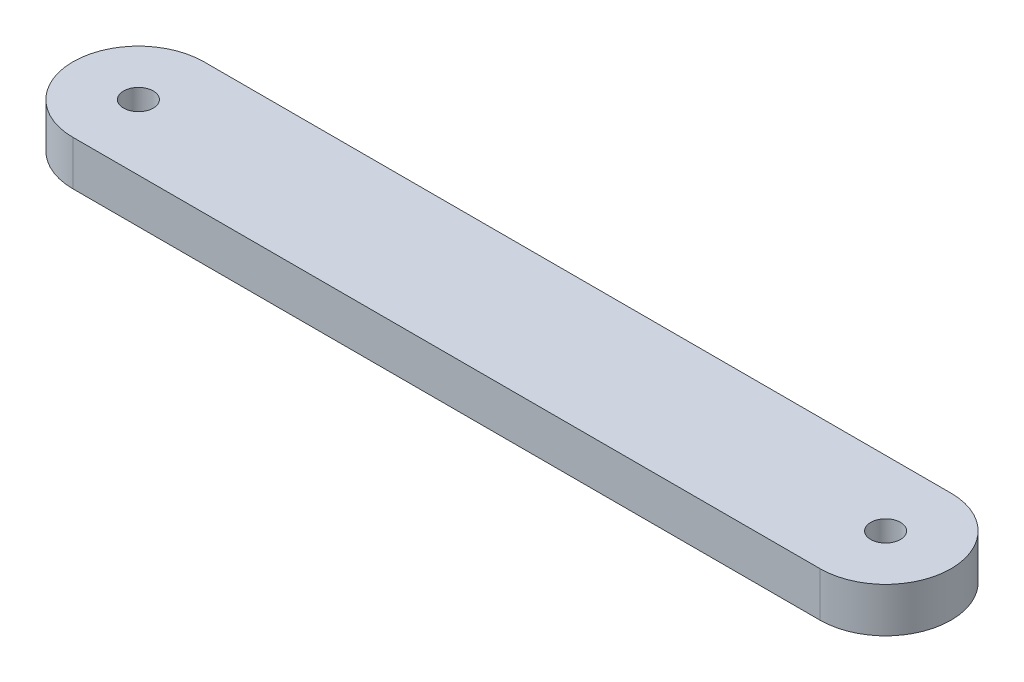
ISO-10303-21;
HEADER;
FILE_DESCRIPTION(('STEP AP214'),'2;1');
FILE_NAME('part.step','',(''),(''),'','','');
FILE_SCHEMA(('AUTOMOTIVE_DESIGN { 1 0 10303 214 1 1 1 1 }'));
ENDSEC;
DATA;
#1=APPLICATION_CONTEXT('core data for automotive mechanical design processes');
#2=APPLICATION_PROTOCOL_DEFINITION('international standard','automotive_design',2000,#1);
#3=PRODUCT_CONTEXT('',#1,'mechanical');
#4=PRODUCT('Part','Part','',(#3));
#5=PRODUCT_RELATED_PRODUCT_CATEGORY('part','',(#4));
#6=PRODUCT_DEFINITION_FORMATION('','',#4);
#7=PRODUCT_DEFINITION_CONTEXT('part definition',#1,'design');
#8=PRODUCT_DEFINITION('design','',#6,#7);
#9=PRODUCT_DEFINITION_SHAPE('','',#8);
#10=(LENGTH_UNIT() NAMED_UNIT(*) SI_UNIT(.MILLI.,.METRE.));
#11=(NAMED_UNIT(*) PLANE_ANGLE_UNIT() SI_UNIT($,.RADIAN.));
#12=(NAMED_UNIT(*) SI_UNIT($,.STERADIAN.) SOLID_ANGLE_UNIT());
#13=UNCERTAINTY_MEASURE_WITH_UNIT(LENGTH_MEASURE(1.E-05),#10,'distance_accuracy_value','');
#14=(GEOMETRIC_REPRESENTATION_CONTEXT(3) GLOBAL_UNCERTAINTY_ASSIGNED_CONTEXT((#13)) GLOBAL_UNIT_ASSIGNED_CONTEXT((#10,
#11,#12)) REPRESENTATION_CONTEXT('',''));
#15=CARTESIAN_POINT('',(0.,0.,0.));
#16=DIRECTION('',(0.,0.,1.));
#17=DIRECTION('',(1.,0.,0.));
#18=AXIS2_PLACEMENT_3D('',#15,#16,#17);
#19=CARTESIAN_POINT('',(-12.555,1.5,0.));
#20=DIRECTION('',(0.,1.,0.));
#21=DIRECTION('',(0.,0.,1.));
#22=AXIS2_PLACEMENT_3D('',#19,#20,#21);
#23=PLANE('',#22);
#24=CARTESIAN_POINT('',(-12.555,1.5,0.));
#25=DIRECTION('',(0.,1.,0.));
#26=DIRECTION('',(0.,0.,1.));
#27=AXIS2_PLACEMENT_3D('',#24,#25,#26);
#28=CIRCLE('',#27,0.500000000000001);
#29=CARTESIAN_POINT('',(-12.555,1.5,0.500000000000001));
#30=VERTEX_POINT('',#29);
#31=EDGE_CURVE('E102',#30,#30,#28,.T.);
#32=ORIENTED_EDGE('',*,*,#31,.F.);
#33=EDGE_LOOP('',(#32));
#34=FACE_BOUND('',#33,.T.);
#35=CARTESIAN_POINT('',(-12.555,1.5,0.));
#36=DIRECTION('',(0.,1.,0.));
#37=DIRECTION('',(0.,0.,1.));
#38=AXIS2_PLACEMENT_3D('',#35,#36,#37);
#39=CIRCLE('',#38,2.2);
#40=CARTESIAN_POINT('',(-12.555,1.5,-2.2));
#41=VERTEX_POINT('',#40);
#42=CARTESIAN_POINT('',(-12.555,1.5,2.2));
#43=VERTEX_POINT('',#42);
#44=EDGE_CURVE('E87',#41,#43,#39,.T.);
#45=ORIENTED_EDGE('',*,*,#44,.T.);
#46=DIRECTION('',(1.,0.,0.));
#47=VECTOR('',#46,1.);
#48=CARTESIAN_POINT('',(-12.555,1.5,2.2));
#49=LINE('',#48,#47);
#50=CARTESIAN_POINT('',(12.555,1.5,2.2));
#51=VERTEX_POINT('',#50);
#52=EDGE_CURVE('E82',#43,#51,#49,.T.);
#53=ORIENTED_EDGE('',*,*,#52,.T.);
#54=CARTESIAN_POINT('',(12.555,1.5,0.));
#55=DIRECTION('',(0.,1.,0.));
#56=DIRECTION('',(0.,0.,1.));
#57=AXIS2_PLACEMENT_3D('',#54,#55,#56);
#58=CIRCLE('',#57,2.2);
#59=CARTESIAN_POINT('',(12.555,1.5,-2.2));
#60=VERTEX_POINT('',#59);
#61=EDGE_CURVE('E85',#51,#60,#58,.T.);
#62=ORIENTED_EDGE('',*,*,#61,.T.);
#63=DIRECTION('',(-1.,0.,0.));
#64=VECTOR('',#63,1.);
#65=CARTESIAN_POINT('',(-12.555,1.5,-2.2));
#66=LINE('',#65,#64);
#67=EDGE_CURVE('E52',#60,#41,#66,.T.);
#68=ORIENTED_EDGE('',*,*,#67,.T.);
#69=EDGE_LOOP('',(#45,#53,#62,#68));
#70=FACE_BOUND('',#69,.T.);
#71=CARTESIAN_POINT('',(12.555,1.5,0.));
#72=DIRECTION('',(0.,1.,0.));
#73=DIRECTION('',(0.,0.,1.));
#74=AXIS2_PLACEMENT_3D('',#71,#72,#73);
#75=CIRCLE('',#74,0.500000000000001);
#76=CARTESIAN_POINT('',(12.555,1.5,0.500000000000001));
#77=VERTEX_POINT('',#76);
#78=EDGE_CURVE('E117',#77,#77,#75,.T.);
#79=ORIENTED_EDGE('',*,*,#78,.F.);
#80=EDGE_LOOP('',(#79));
#81=FACE_BOUND('',#80,.T.);
#82=ADVANCED_FACE('F35',(#34,#70,#81),#23,.T.);
#83=CARTESIAN_POINT('',(-12.555,0.,0.));
#84=DIRECTION('',(0.,1.,0.));
#85=DIRECTION('',(0.,0.,1.));
#86=AXIS2_PLACEMENT_3D('',#83,#84,#85);
#87=PLANE('',#86);
#88=CARTESIAN_POINT('',(-12.555,0.,0.));
#89=DIRECTION('',(0.,1.,0.));
#90=DIRECTION('',(0.,0.,1.));
#91=AXIS2_PLACEMENT_3D('',#88,#89,#90);
#92=CIRCLE('',#91,2.2);
#93=CARTESIAN_POINT('',(-12.555,0.,-2.2));
#94=VERTEX_POINT('',#93);
#95=CARTESIAN_POINT('',(-12.555,0.,2.2));
#96=VERTEX_POINT('',#95);
#97=EDGE_CURVE('E99',#94,#96,#92,.T.);
#98=ORIENTED_EDGE('',*,*,#97,.F.);
#99=DIRECTION('',(-1.,0.,0.));
#100=VECTOR('',#99,1.);
#101=CARTESIAN_POINT('',(-12.555,0.,-2.2));
#102=LINE('',#101,#100);
#103=CARTESIAN_POINT('',(12.555,0.,-2.2));
#104=VERTEX_POINT('',#103);
#105=EDGE_CURVE('E75',#104,#94,#102,.T.);
#106=ORIENTED_EDGE('',*,*,#105,.F.);
#107=CARTESIAN_POINT('',(12.555,0.,0.));
#108=DIRECTION('',(0.,1.,0.));
#109=DIRECTION('',(0.,0.,1.));
#110=AXIS2_PLACEMENT_3D('',#107,#108,#109);
#111=CIRCLE('',#110,2.2);
#112=CARTESIAN_POINT('',(12.555,0.,2.2));
#113=VERTEX_POINT('',#112);
#114=EDGE_CURVE('E69',#113,#104,#111,.T.);
#115=ORIENTED_EDGE('',*,*,#114,.F.);
#116=DIRECTION('',(1.,0.,0.));
#117=VECTOR('',#116,1.);
#118=CARTESIAN_POINT('',(-12.555,0.,2.2));
#119=LINE('',#118,#117);
#120=EDGE_CURVE('E91',#96,#113,#119,.T.);
#121=ORIENTED_EDGE('',*,*,#120,.F.);
#122=EDGE_LOOP('',(#98,#106,#115,#121));
#123=FACE_BOUND('',#122,.T.);
#124=CARTESIAN_POINT('',(-12.555,0.,0.));
#125=DIRECTION('',(0.,1.,0.));
#126=DIRECTION('',(0.,0.,1.));
#127=AXIS2_PLACEMENT_3D('',#124,#125,#126);
#128=CIRCLE('',#127,0.500000000000001);
#129=CARTESIAN_POINT('',(-12.555,0.,0.500000000000001));
#130=VERTEX_POINT('',#129);
#131=EDGE_CURVE('E114',#130,#130,#128,.T.);
#132=ORIENTED_EDGE('',*,*,#131,.T.);
#133=EDGE_LOOP('',(#132));
#134=FACE_BOUND('',#133,.T.);
#135=CARTESIAN_POINT('',(12.555,0.,0.));
#136=DIRECTION('',(0.,1.,0.));
#137=DIRECTION('',(0.,0.,1.));
#138=AXIS2_PLACEMENT_3D('',#135,#136,#137);
#139=CIRCLE('',#138,0.500000000000001);
#140=CARTESIAN_POINT('',(12.555,0.,0.500000000000001));
#141=VERTEX_POINT('',#140);
#142=EDGE_CURVE('E120',#141,#141,#139,.T.);
#143=ORIENTED_EDGE('',*,*,#142,.T.);
#144=EDGE_LOOP('',(#143));
#145=FACE_BOUND('',#144,.T.);
#146=ADVANCED_FACE('F110',(#123,#134,#145),#87,.F.);
#147=CARTESIAN_POINT('',(-12.555,1.5,0.));
#148=DIRECTION('',(0.,-1.,0.));
#149=DIRECTION('',(0.,0.,-1.));
#150=AXIS2_PLACEMENT_3D('',#147,#148,#149);
#151=CYLINDRICAL_SURFACE('',#150,2.2);
#152=ORIENTED_EDGE('',*,*,#97,.T.);
#153=DIRECTION('',(0.,-1.,0.));
#154=VECTOR('',#153,1.);
#155=CARTESIAN_POINT('',(-12.555,1.5,2.2));
#156=LINE('',#155,#154);
#157=EDGE_CURVE('E11',#43,#96,#156,.T.);
#158=ORIENTED_EDGE('',*,*,#157,.F.);
#159=ORIENTED_EDGE('',*,*,#44,.F.);
#160=DIRECTION('',(0.,-1.,0.));
#161=VECTOR('',#160,1.);
#162=CARTESIAN_POINT('',(-12.555,1.5,-2.2));
#163=LINE('',#162,#161);
#164=EDGE_CURVE('E95',#41,#94,#163,.T.);
#165=ORIENTED_EDGE('',*,*,#164,.T.);
#166=EDGE_LOOP('',(#152,#158,#159,#165));
#167=FACE_BOUND('',#166,.T.);
#168=ADVANCED_FACE('F37',(#167),#151,.T.);
#169=CARTESIAN_POINT('',(-12.555,1.5,2.2));
#170=DIRECTION('',(0.,0.,-1.));
#171=DIRECTION('',(-1.,0.,0.));
#172=AXIS2_PLACEMENT_3D('',#169,#170,#171);
#173=PLANE('',#172);
#174=ORIENTED_EDGE('',*,*,#120,.T.);
#175=DIRECTION('',(0.,-1.,0.));
#176=VECTOR('',#175,1.);
#177=CARTESIAN_POINT('',(12.555,1.5,2.2));
#178=LINE('',#177,#176);
#179=EDGE_CURVE('E44',#51,#113,#178,.T.);
#180=ORIENTED_EDGE('',*,*,#179,.F.);
#181=ORIENTED_EDGE('',*,*,#52,.F.);
#182=ORIENTED_EDGE('',*,*,#157,.T.);
#183=EDGE_LOOP('',(#174,#180,#181,#182));
#184=FACE_BOUND('',#183,.T.);
#185=ADVANCED_FACE('F90',(#184),#173,.F.);
#186=CARTESIAN_POINT('',(12.555,1.5,0.));
#187=DIRECTION('',(0.,-1.,0.));
#188=DIRECTION('',(0.,0.,-1.));
#189=AXIS2_PLACEMENT_3D('',#186,#187,#188);
#190=CYLINDRICAL_SURFACE('',#189,2.2);
#191=ORIENTED_EDGE('',*,*,#114,.T.);
#192=DIRECTION('',(0.,-1.,0.));
#193=VECTOR('',#192,1.);
#194=CARTESIAN_POINT('',(12.555,1.5,-2.2));
#195=LINE('',#194,#193);
#196=EDGE_CURVE('E92',#60,#104,#195,.T.);
#197=ORIENTED_EDGE('',*,*,#196,.F.);
#198=ORIENTED_EDGE('',*,*,#61,.F.);
#199=ORIENTED_EDGE('',*,*,#179,.T.);
#200=EDGE_LOOP('',(#191,#197,#198,#199));
#201=FACE_BOUND('',#200,.T.);
#202=ADVANCED_FACE('F93',(#201),#190,.T.);
#203=CARTESIAN_POINT('',(-12.555,1.5,-2.2));
#204=DIRECTION('',(0.,0.,1.));
#205=DIRECTION('',(1.,0.,0.));
#206=AXIS2_PLACEMENT_3D('',#203,#204,#205);
#207=PLANE('',#206);
#208=ORIENTED_EDGE('',*,*,#105,.T.);
#209=ORIENTED_EDGE('',*,*,#164,.F.);
#210=ORIENTED_EDGE('',*,*,#67,.F.);
#211=ORIENTED_EDGE('',*,*,#196,.T.);
#212=EDGE_LOOP('',(#208,#209,#210,#211));
#213=FACE_BOUND('',#212,.T.);
#214=ADVANCED_FACE('F107',(#213),#207,.F.);
#215=CARTESIAN_POINT('',(-12.555,1.5,0.));
#216=DIRECTION('',(0.,-1.,0.));
#217=DIRECTION('',(0.,0.,-1.));
#218=AXIS2_PLACEMENT_3D('',#215,#216,#217);
#219=CYLINDRICAL_SURFACE('',#218,0.500000000000001);
#220=ORIENTED_EDGE('',*,*,#31,.T.);
#221=EDGE_LOOP('',(#220));
#222=FACE_BOUND('',#221,.T.);
#223=ORIENTED_EDGE('',*,*,#131,.F.);
#224=EDGE_LOOP('',(#223));
#225=FACE_BOUND('',#224,.T.);
#226=ADVANCED_FACE('F137',(#222,#225),#219,.F.);
#227=CARTESIAN_POINT('',(12.555,1.5,0.));
#228=DIRECTION('',(0.,-1.,0.));
#229=DIRECTION('',(0.,0.,-1.));
#230=AXIS2_PLACEMENT_3D('',#227,#228,#229);
#231=CYLINDRICAL_SURFACE('',#230,0.500000000000001);
#232=ORIENTED_EDGE('',*,*,#78,.T.);
#233=EDGE_LOOP('',(#232));
#234=FACE_BOUND('',#233,.T.);
#235=ORIENTED_EDGE('',*,*,#142,.F.);
#236=EDGE_LOOP('',(#235));
#237=FACE_BOUND('',#236,.T.);
#238=ADVANCED_FACE('F126',(#234,#237),#231,.F.);
#239=CLOSED_SHELL('',(#82,#146,#168,#185,#202,#214,#226,#238));
#240=MANIFOLD_SOLID_BREP('B2',#239);
#241=ADVANCED_BREP_SHAPE_REPRESENTATION('',(#18,#240),#14);
#242=SHAPE_DEFINITION_REPRESENTATION(#9,#241);
ENDSEC;
END-ISO-10303-21;
